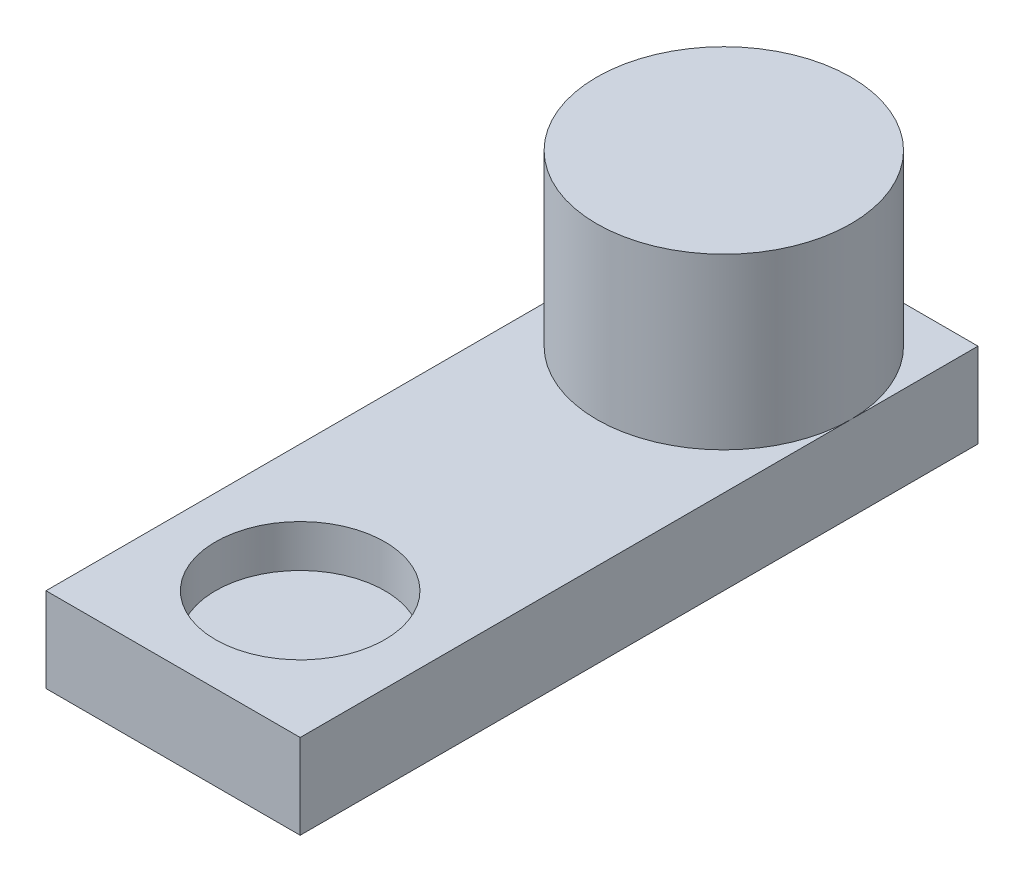
ISO-10303-21;
HEADER;
FILE_DESCRIPTION(('STEP AP214'),'2;1');
FILE_NAME('part.step','',(''),(''),'','','');
FILE_SCHEMA(('AUTOMOTIVE_DESIGN { 1 0 10303 214 1 1 1 1 }'));
ENDSEC;
DATA;
#1=APPLICATION_CONTEXT('core data for automotive mechanical design processes');
#2=APPLICATION_PROTOCOL_DEFINITION('international standard','automotive_design',2000,#1);
#3=PRODUCT_CONTEXT('',#1,'mechanical');
#4=PRODUCT('Part','Part','',(#3));
#5=PRODUCT_RELATED_PRODUCT_CATEGORY('part','',(#4));
#6=PRODUCT_DEFINITION_FORMATION('','',#4);
#7=PRODUCT_DEFINITION_CONTEXT('part definition',#1,'design');
#8=PRODUCT_DEFINITION('design','',#6,#7);
#9=PRODUCT_DEFINITION_SHAPE('','',#8);
#10=(LENGTH_UNIT() NAMED_UNIT(*) SI_UNIT(.MILLI.,.METRE.));
#11=(NAMED_UNIT(*) PLANE_ANGLE_UNIT() SI_UNIT($,.RADIAN.));
#12=(NAMED_UNIT(*) SI_UNIT($,.STERADIAN.) SOLID_ANGLE_UNIT());
#13=UNCERTAINTY_MEASURE_WITH_UNIT(LENGTH_MEASURE(1.E-05),#10,'distance_accuracy_value','');
#14=(GEOMETRIC_REPRESENTATION_CONTEXT(3) GLOBAL_UNCERTAINTY_ASSIGNED_CONTEXT((#13)) GLOBAL_UNIT_ASSIGNED_CONTEXT((#10,
#11,#12)) REPRESENTATION_CONTEXT('',''));
#15=CARTESIAN_POINT('',(0.,0.,0.));
#16=DIRECTION('',(0.,0.,1.));
#17=DIRECTION('',(1.,0.,0.));
#18=AXIS2_PLACEMENT_3D('',#15,#16,#17);
#19=CARTESIAN_POINT('',(0.,10.,0.));
#20=DIRECTION('',(0.,-1.,0.));
#21=DIRECTION('',(0.,0.,-1.));
#22=AXIS2_PLACEMENT_3D('',#19,#20,#21);
#23=PLANE('',#22);
#24=CARTESIAN_POINT('',(0.,10.,-25.));
#25=DIRECTION('',(0.,1.,0.));
#26=DIRECTION('',(0.,0.,1.));
#27=AXIS2_PLACEMENT_3D('',#24,#25,#26);
#28=CIRCLE('',#27,15.);
#29=CARTESIAN_POINT('',(15.,10.,-25.));
#30=VERTEX_POINT('',#29);
#31=CARTESIAN_POINT('',(0.,10.,-40.));
#32=VERTEX_POINT('',#31);
#33=EDGE_CURVE('E63',#30,#32,#28,.T.);
#34=ORIENTED_EDGE('',*,*,#33,.F.);
#35=DIRECTION('',(0.,0.,-1.));
#36=VECTOR('',#35,1.);
#37=CARTESIAN_POINT('',(15.,10.,40.));
#38=LINE('',#37,#36);
#39=CARTESIAN_POINT('',(15.,10.,-40.));
#40=VERTEX_POINT('',#39);
#41=EDGE_CURVE('E111',#30,#40,#38,.T.);
#42=ORIENTED_EDGE('',*,*,#41,.T.);
#43=DIRECTION('',(-1.,0.,0.));
#44=VECTOR('',#43,1.);
#45=CARTESIAN_POINT('',(-15.,10.,-40.));
#46=LINE('',#45,#44);
#47=EDGE_CURVE('E123',#40,#32,#46,.T.);
#48=ORIENTED_EDGE('',*,*,#47,.T.);
#49=EDGE_LOOP('',(#34,#42,#48));
#50=FACE_BOUND('',#49,.T.);
#51=ADVANCED_FACE('F50',(#50),#23,.F.);
#52=CARTESIAN_POINT('',(-15.,10.,-25.));
#53=VERTEX_POINT('',#52);
#54=EDGE_CURVE('E12',#32,#53,#28,.T.);
#55=ORIENTED_EDGE('',*,*,#54,.F.);
#56=CARTESIAN_POINT('',(-15.,10.,-40.));
#57=VERTEX_POINT('',#56);
#58=EDGE_CURVE('E110',#32,#57,#46,.T.);
#59=ORIENTED_EDGE('',*,*,#58,.T.);
#60=DIRECTION('',(0.,0.,1.));
#61=VECTOR('',#60,1.);
#62=CARTESIAN_POINT('',(-15.,10.,40.));
#63=LINE('',#62,#61);
#64=EDGE_CURVE('E213',#57,#53,#63,.T.);
#65=ORIENTED_EDGE('',*,*,#64,.T.);
#66=EDGE_LOOP('',(#55,#59,#65));
#67=FACE_BOUND('',#66,.T.);
#68=ADVANCED_FACE('F179',(#67),#23,.F.);
#69=CARTESIAN_POINT('',(15.,10.,40.));
#70=DIRECTION('',(-1.,0.,0.));
#71=DIRECTION('',(0.,0.,1.));
#72=AXIS2_PLACEMENT_3D('',#69,#70,#71);
#73=PLANE('',#72);
#74=DIRECTION('',(0.,0.,-1.));
#75=VECTOR('',#74,1.);
#76=CARTESIAN_POINT('',(15.,0.,40.));
#77=LINE('',#76,#75);
#78=CARTESIAN_POINT('',(15.,0.,40.));
#79=VERTEX_POINT('',#78);
#80=CARTESIAN_POINT('',(15.,0.,-40.));
#81=VERTEX_POINT('',#80);
#82=EDGE_CURVE('E211',#79,#81,#77,.T.);
#83=ORIENTED_EDGE('',*,*,#82,.T.);
#84=DIRECTION('',(0.,-1.,0.));
#85=VECTOR('',#84,1.);
#86=CARTESIAN_POINT('',(15.,10.,-40.));
#87=LINE('',#86,#85);
#88=EDGE_CURVE('E54',#40,#81,#87,.T.);
#89=ORIENTED_EDGE('',*,*,#88,.F.);
#90=ORIENTED_EDGE('',*,*,#41,.F.);
#91=CARTESIAN_POINT('',(15.,10.,40.));
#92=VERTEX_POINT('',#91);
#93=EDGE_CURVE('E101',#92,#30,#38,.T.);
#94=ORIENTED_EDGE('',*,*,#93,.F.);
#95=DIRECTION('',(0.,-1.,0.));
#96=VECTOR('',#95,1.);
#97=CARTESIAN_POINT('',(15.,10.,40.));
#98=LINE('',#97,#96);
#99=EDGE_CURVE('E152',#92,#79,#98,.T.);
#100=ORIENTED_EDGE('',*,*,#99,.T.);
#101=EDGE_LOOP('',(#83,#89,#90,#94,#100));
#102=FACE_BOUND('',#101,.T.);
#103=ADVANCED_FACE('F52',(#102),#73,.F.);
#104=CARTESIAN_POINT('',(-15.,10.,-40.));
#105=DIRECTION('',(0.,0.,1.));
#106=DIRECTION('',(1.,0.,0.));
#107=AXIS2_PLACEMENT_3D('',#104,#105,#106);
#108=PLANE('',#107);
#109=DIRECTION('',(-1.,0.,0.));
#110=VECTOR('',#109,1.);
#111=CARTESIAN_POINT('',(-15.,0.,-40.));
#112=LINE('',#111,#110);
#113=CARTESIAN_POINT('',(-15.,0.,-40.));
#114=VERTEX_POINT('',#113);
#115=EDGE_CURVE('E206',#81,#114,#112,.T.);
#116=ORIENTED_EDGE('',*,*,#115,.T.);
#117=DIRECTION('',(0.,-1.,0.));
#118=VECTOR('',#117,1.);
#119=CARTESIAN_POINT('',(-15.,10.,-40.));
#120=LINE('',#119,#118);
#121=EDGE_CURVE('E131',#57,#114,#120,.T.);
#122=ORIENTED_EDGE('',*,*,#121,.F.);
#123=ORIENTED_EDGE('',*,*,#58,.F.);
#124=ORIENTED_EDGE('',*,*,#47,.F.);
#125=ORIENTED_EDGE('',*,*,#88,.T.);
#126=EDGE_LOOP('',(#116,#122,#123,#124,#125));
#127=FACE_BOUND('',#126,.T.);
#128=ADVANCED_FACE('F195',(#127),#108,.F.);
#129=CARTESIAN_POINT('',(-15.,10.,40.));
#130=DIRECTION('',(1.,0.,0.));
#131=DIRECTION('',(0.,0.,-1.));
#132=AXIS2_PLACEMENT_3D('',#129,#130,#131);
#133=PLANE('',#132);
#134=DIRECTION('',(0.,0.,1.));
#135=VECTOR('',#134,1.);
#136=CARTESIAN_POINT('',(-15.,0.,40.));
#137=LINE('',#136,#135);
#138=CARTESIAN_POINT('',(-15.,0.,40.));
#139=VERTEX_POINT('',#138);
#140=EDGE_CURVE('E158',#114,#139,#137,.T.);
#141=ORIENTED_EDGE('',*,*,#140,.T.);
#142=DIRECTION('',(0.,-1.,0.));
#143=VECTOR('',#142,1.);
#144=CARTESIAN_POINT('',(-15.,10.,40.));
#145=LINE('',#144,#143);
#146=CARTESIAN_POINT('',(-15.,10.,40.));
#147=VERTEX_POINT('',#146);
#148=EDGE_CURVE('E148',#147,#139,#145,.T.);
#149=ORIENTED_EDGE('',*,*,#148,.F.);
#150=EDGE_CURVE('E332',#53,#147,#63,.T.);
#151=ORIENTED_EDGE('',*,*,#150,.F.);
#152=ORIENTED_EDGE('',*,*,#64,.F.);
#153=ORIENTED_EDGE('',*,*,#121,.T.);
#154=EDGE_LOOP('',(#141,#149,#151,#152,#153));
#155=FACE_BOUND('',#154,.T.);
#156=ADVANCED_FACE('F186',(#155),#133,.F.);
#157=CARTESIAN_POINT('',(-15.,10.,40.));
#158=DIRECTION('',(0.,0.,-1.));
#159=DIRECTION('',(-1.,0.,0.));
#160=AXIS2_PLACEMENT_3D('',#157,#158,#159);
#161=PLANE('',#160);
#162=DIRECTION('',(1.,0.,0.));
#163=VECTOR('',#162,1.);
#164=CARTESIAN_POINT('',(-15.,0.,40.));
#165=LINE('',#164,#163);
#166=EDGE_CURVE('E121',#139,#79,#165,.T.);
#167=ORIENTED_EDGE('',*,*,#166,.T.);
#168=ORIENTED_EDGE('',*,*,#99,.F.);
#169=DIRECTION('',(1.,0.,0.));
#170=VECTOR('',#169,1.);
#171=CARTESIAN_POINT('',(-15.,10.,40.));
#172=LINE('',#171,#170);
#173=EDGE_CURVE('E105',#147,#92,#172,.T.);
#174=ORIENTED_EDGE('',*,*,#173,.F.);
#175=ORIENTED_EDGE('',*,*,#148,.T.);
#176=EDGE_LOOP('',(#167,#168,#174,#175));
#177=FACE_BOUND('',#176,.T.);
#178=ADVANCED_FACE('F177',(#177),#161,.F.);
#179=CARTESIAN_POINT('',(0.,10.,25.));
#180=DIRECTION('',(0.,1.,0.));
#181=DIRECTION('',(0.,0.,1.));
#182=AXIS2_PLACEMENT_3D('',#179,#180,#181);
#183=CIRCLE('',#182,10.);
#184=CARTESIAN_POINT('',(0.,10.,35.));
#185=VERTEX_POINT('',#184);
#186=EDGE_CURVE('E167',#185,#185,#183,.T.);
#187=ORIENTED_EDGE('',*,*,#186,.F.);
#188=EDGE_LOOP('',(#187));
#189=FACE_BOUND('',#188,.T.);
#190=EDGE_CURVE('E61',#53,#30,#28,.T.);
#191=ORIENTED_EDGE('',*,*,#190,.F.);
#192=ORIENTED_EDGE('',*,*,#150,.T.);
#193=ORIENTED_EDGE('',*,*,#173,.T.);
#194=ORIENTED_EDGE('',*,*,#93,.T.);
#195=EDGE_LOOP('',(#191,#192,#193,#194));
#196=FACE_BOUND('',#195,.T.);
#197=ADVANCED_FACE('F103',(#189,#196),#23,.F.);
#198=CARTESIAN_POINT('',(0.,0.,0.));
#199=DIRECTION('',(0.,-1.,0.));
#200=DIRECTION('',(0.,0.,-1.));
#201=AXIS2_PLACEMENT_3D('',#198,#199,#200);
#202=PLANE('',#201);
#203=ORIENTED_EDGE('',*,*,#82,.F.);
#204=ORIENTED_EDGE('',*,*,#166,.F.);
#205=ORIENTED_EDGE('',*,*,#140,.F.);
#206=ORIENTED_EDGE('',*,*,#115,.F.);
#207=EDGE_LOOP('',(#203,#204,#205,#206));
#208=FACE_BOUND('',#207,.T.);
#209=ADVANCED_FACE('F176',(#208),#202,.T.);
#210=CARTESIAN_POINT('',(0.,30.,-25.));
#211=DIRECTION('',(0.,-1.,0.));
#212=DIRECTION('',(0.,0.,-1.));
#213=AXIS2_PLACEMENT_3D('',#210,#211,#212);
#214=CYLINDRICAL_SURFACE('',#213,15.);
#215=CARTESIAN_POINT('',(0.,30.,-25.));
#216=DIRECTION('',(0.,1.,0.));
#217=DIRECTION('',(0.,0.,1.));
#218=AXIS2_PLACEMENT_3D('',#215,#216,#217);
#219=CIRCLE('',#218,15.);
#220=CARTESIAN_POINT('',(0.,30.,-10.));
#221=VERTEX_POINT('',#220);
#222=EDGE_CURVE('E126',#221,#221,#219,.T.);
#223=ORIENTED_EDGE('',*,*,#222,.F.);
#224=EDGE_LOOP('',(#223));
#225=FACE_BOUND('',#224,.T.);
#226=ORIENTED_EDGE('',*,*,#33,.T.);
#227=ORIENTED_EDGE('',*,*,#54,.T.);
#228=ORIENTED_EDGE('',*,*,#190,.T.);
#229=EDGE_LOOP('',(#226,#227,#228));
#230=FACE_BOUND('',#229,.T.);
#231=ADVANCED_FACE('F128',(#225,#230),#214,.T.);
#232=CARTESIAN_POINT('',(0.,30.,-25.));
#233=DIRECTION('',(0.,1.,0.));
#234=DIRECTION('',(0.,0.,1.));
#235=AXIS2_PLACEMENT_3D('',#232,#233,#234);
#236=PLANE('',#235);
#237=ORIENTED_EDGE('',*,*,#222,.T.);
#238=EDGE_LOOP('',(#237));
#239=FACE_BOUND('',#238,.T.);
#240=ADVANCED_FACE('F221',(#239),#236,.T.);
#241=CARTESIAN_POINT('',(0.,5.,25.));
#242=DIRECTION('',(0.,1.,0.));
#243=DIRECTION('',(0.,0.,1.));
#244=AXIS2_PLACEMENT_3D('',#241,#242,#243);
#245=CYLINDRICAL_SURFACE('',#244,10.);
#246=CARTESIAN_POINT('',(0.,5.,25.));
#247=DIRECTION('',(0.,1.,0.));
#248=DIRECTION('',(0.,0.,1.));
#249=AXIS2_PLACEMENT_3D('',#246,#247,#248);
#250=CIRCLE('',#249,10.);
#251=CARTESIAN_POINT('',(0.,5.,35.));
#252=VERTEX_POINT('',#251);
#253=EDGE_CURVE('E127',#252,#252,#250,.T.);
#254=ORIENTED_EDGE('',*,*,#253,.F.);
#255=EDGE_LOOP('',(#254));
#256=FACE_BOUND('',#255,.T.);
#257=ORIENTED_EDGE('',*,*,#186,.T.);
#258=EDGE_LOOP('',(#257));
#259=FACE_BOUND('',#258,.T.);
#260=ADVANCED_FACE('F173',(#256,#259),#245,.F.);
#261=CARTESIAN_POINT('',(0.,5.,25.));
#262=DIRECTION('',(0.,1.,0.));
#263=DIRECTION('',(0.,0.,1.));
#264=AXIS2_PLACEMENT_3D('',#261,#262,#263);
#265=PLANE('',#264);
#266=ORIENTED_EDGE('',*,*,#253,.T.);
#267=EDGE_LOOP('',(#266));
#268=FACE_BOUND('',#267,.T.);
#269=ADVANCED_FACE('F231',(#268),#265,.T.);
#270=CLOSED_SHELL('',(#51,#68,#103,#128,#156,#178,#197,#209,#231,#240,#260,#269));
#271=MANIFOLD_SOLID_BREP('B2',#270);
#272=ADVANCED_BREP_SHAPE_REPRESENTATION('',(#18,#271),#14);
#273=SHAPE_DEFINITION_REPRESENTATION(#9,#272);
ENDSEC;
END-ISO-10303-21;
